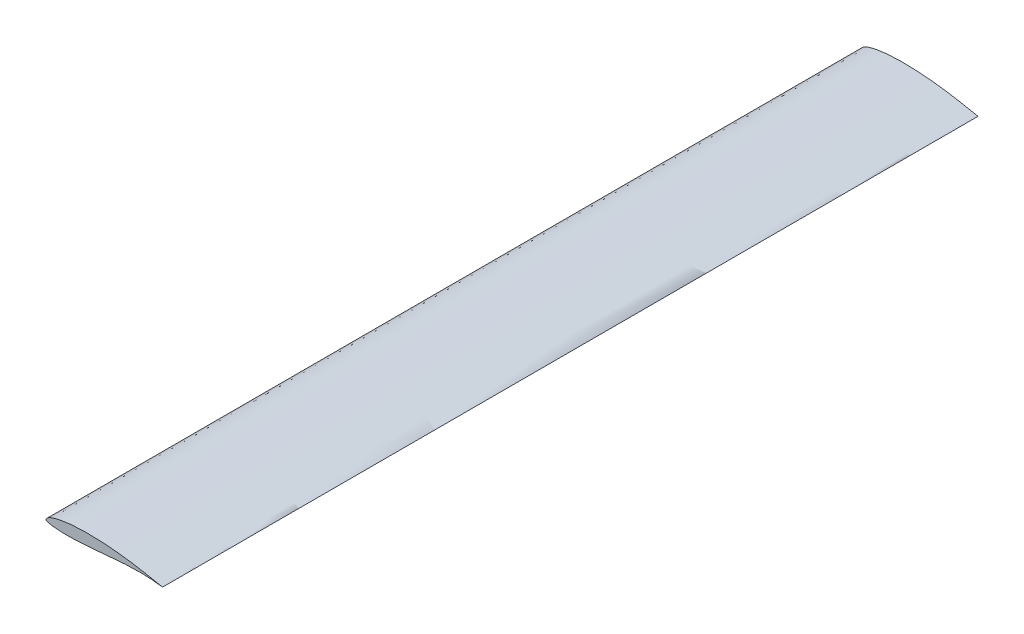
ISO-10303-21;
HEADER;
FILE_DESCRIPTION(('STEP AP214'),'2;1');
FILE_NAME('part.step','',(''),(''),'','','');
FILE_SCHEMA(('AUTOMOTIVE_DESIGN { 1 0 10303 214 1 1 1 1 }'));
ENDSEC;
DATA;
#1=APPLICATION_CONTEXT('core data for automotive mechanical design processes');
#2=APPLICATION_PROTOCOL_DEFINITION('international standard','automotive_design',2000,#1);
#3=PRODUCT_CONTEXT('',#1,'mechanical');
#4=PRODUCT('Part','Part','',(#3));
#5=PRODUCT_RELATED_PRODUCT_CATEGORY('part','',(#4));
#6=PRODUCT_DEFINITION_FORMATION('','',#4);
#7=PRODUCT_DEFINITION_CONTEXT('part definition',#1,'design');
#8=PRODUCT_DEFINITION('design','',#6,#7);
#9=PRODUCT_DEFINITION_SHAPE('','',#8);
#10=(LENGTH_UNIT() NAMED_UNIT(*) SI_UNIT(.MILLI.,.METRE.));
#11=(NAMED_UNIT(*) PLANE_ANGLE_UNIT() SI_UNIT($,.RADIAN.));
#12=(NAMED_UNIT(*) SI_UNIT($,.STERADIAN.) SOLID_ANGLE_UNIT());
#13=UNCERTAINTY_MEASURE_WITH_UNIT(LENGTH_MEASURE(1.E-05),#10,'distance_accuracy_value','');
#14=(GEOMETRIC_REPRESENTATION_CONTEXT(3) GLOBAL_UNCERTAINTY_ASSIGNED_CONTEXT((#13)) GLOBAL_UNIT_ASSIGNED_CONTEXT((#10,
#11,#12)) REPRESENTATION_CONTEXT('',''));
#15=CARTESIAN_POINT('',(0.,0.,0.));
#16=DIRECTION('',(0.,0.,1.));
#17=DIRECTION('',(1.,0.,0.));
#18=AXIS2_PLACEMENT_3D('',#15,#16,#17);
#19=CARTESIAN_POINT('',(164.,0.,1147.5));
#20=CARTESIAN_POINT('',(164.001991598263,0.00531984976419303,1147.5));
#21=CARTESIAN_POINT('',(162.498434342582,0.297400202803964,1147.5));
#22=CARTESIAN_POINT('',(160.966285986864,0.616919952057619,1147.5));
#23=CARTESIAN_POINT('',(157.230075915864,1.3585498102464,1147.5));
#24=CARTESIAN_POINT('',(152.647727614488,2.27665522942378,1147.5));
#25=CARTESIAN_POINT('',(146.674778271279,3.45259340113249,1147.5));
#26=CARTESIAN_POINT('',(139.663921430945,4.78810763818938,1147.5));
#27=CARTESIAN_POINT('',(131.643002501888,6.22552345397432,1147.5));
#28=CARTESIAN_POINT('',(122.779722168183,7.67812054914313,1147.5));
#29=CARTESIAN_POINT('',(113.214717927563,9.06260953662403,1147.5));
#30=CARTESIAN_POINT('',(103.114761215838,10.3086780802257,1147.5));
#31=CARTESIAN_POINT('',(92.6533309547815,11.3668746634096,1147.5));
#32=CARTESIAN_POINT('',(82.0086806238588,12.1835709086589,1147.5));
#33=CARTESIAN_POINT('',(71.3637171378707,12.732678493942,1147.5));
#34=CARTESIAN_POINT('',(62.573062305257,12.9388201280609,1147.5));
#35=CARTESIAN_POINT('',(55.6792196157442,12.9316295832505,1147.5));
#36=CARTESIAN_POINT('',(50.6637926196718,12.8397286640108,1147.5));
#37=CARTESIAN_POINT('',(45.7821815615309,12.6594632047961,1147.5));
#38=CARTESIAN_POINT('',(41.0552392078456,12.3903784997006,1147.5));
#39=CARTESIAN_POINT('',(36.503682969376,12.0364374732333,1147.5));
#40=CARTESIAN_POINT('',(32.1469308752692,11.6017806713784,1147.5));
#41=CARTESIAN_POINT('',(28.0042399944486,11.0851428613257,1147.5));
#42=CARTESIAN_POINT('',(24.0917028645816,10.4983490102485,1147.5));
#43=CARTESIAN_POINT('',(20.4268224736298,9.84391818251182,1147.5));
#44=CARTESIAN_POINT('',(17.0258441320521,9.13083356361227,1147.5));
#45=CARTESIAN_POINT('',(13.9022307091455,8.36935884084965,1147.5));
#46=CARTESIAN_POINT('',(11.0683356300652,7.56556299579602,1147.5));
#47=CARTESIAN_POINT('',(8.53577437049558,6.72011862060174,1147.5));
#48=CARTESIAN_POINT('',(6.31237905524054,5.83291609249776,1147.5));
#49=CARTESIAN_POINT('',(4.41335195887076,4.89013994016945,1147.5));
#50=CARTESIAN_POINT('',(2.84511205003182,3.90324504676575,1147.5));
#51=CARTESIAN_POINT('',(1.62045759786148,2.90112706142947,1147.5));
#52=CARTESIAN_POINT('',(0.73116509275038,1.93808069211739,1147.5));
#53=CARTESIAN_POINT('',(0.179493112111483,1.06867443061584,1147.5));
#54=CARTESIAN_POINT('',(-0.0694620851703839,0.284825746109623,1147.5));
#55=CARTESIAN_POINT('',(0.134033799734411,-0.423690631352367,1147.5));
#56=CARTESIAN_POINT('',(0.764071957071735,-0.90315248643549,1147.5));
#57=CARTESIAN_POINT('',(1.66761423003734,-1.28501260569411,1147.5));
#58=CARTESIAN_POINT('',(2.89636931032193,-1.66786040813617,1147.5));
#59=CARTESIAN_POINT('',(4.45436899457472,-2.06075475528505,1147.5));
#60=CARTESIAN_POINT('',(6.34218466816148,-2.4632681114056,1147.5));
#61=CARTESIAN_POINT('',(8.55467856408679,-2.84918902931242,1147.5));
#62=CARTESIAN_POINT('',(11.0821535753536,-3.19703608864089,1147.5));
#63=CARTESIAN_POINT('',(13.9135484504474,-3.48962360207447,1147.5));
#64=CARTESIAN_POINT('',(17.0354737545351,-3.73342689550393,1147.5));
#65=CARTESIAN_POINT('',(20.4356518775566,-3.91918489225184,1147.5));
#66=CARTESIAN_POINT('',(24.099392464432,-4.05492611325174,1147.5));
#67=CARTESIAN_POINT('',(28.0108551367806,-4.12753853381065,1147.5));
#68=CARTESIAN_POINT('',(32.1529214072361,-4.14098809865655,1147.5));
#69=CARTESIAN_POINT('',(36.5088006016332,-4.08249920879109,1147.5));
#70=CARTESIAN_POINT('',(41.0598347493383,-3.94919102069968,1147.5));
#71=CARTESIAN_POINT('',(45.7862678553855,-3.73671060947181,1147.5));
#72=CARTESIAN_POINT('',(50.667246714286,-3.44561856035242,1147.5));
#73=CARTESIAN_POINT('',(55.6814877677775,-3.0779528117554,1147.5));
#74=CARTESIAN_POINT('',(62.5754290442507,-2.50996480013426,1147.5));
#75=CARTESIAN_POINT('',(71.3600135467517,-1.68784839412556,1147.5));
#76=CARTESIAN_POINT('',(81.9977407502253,-0.654631350776393,1147.5));
#77=CARTESIAN_POINT('',(92.6365558877666,0.330119403039373,1147.5));
#78=CARTESIAN_POINT('',(103.095163283197,1.17421806949481,1147.5));
#79=CARTESIAN_POINT('',(113.195150773304,1.80138175037423,1147.5));
#80=CARTESIAN_POINT('',(122.763237889367,2.17576205056045,1147.5));
#81=CARTESIAN_POINT('',(131.632477934741,2.28410167210576,1147.5));
#82=CARTESIAN_POINT('',(139.659679628837,2.14727547238049,1147.5));
#83=CARTESIAN_POINT('',(146.676584213066,1.82633503353171,1147.5));
#84=CARTESIAN_POINT('',(152.651459072662,1.37759986618992,1147.5));
#85=CARTESIAN_POINT('',(157.237589271037,0.92499442356592,1147.5));
#86=CARTESIAN_POINT('',(160.965141957451,0.442021742113606,1147.5));
#87=CARTESIAN_POINT('',(162.505368274,0.239871332988406,1147.5));
#88=CARTESIAN_POINT('',(163.998025245982,-0.00527485632708962,1147.5));
#89=CARTESIAN_POINT('',(164.,0.,1147.5));
#90=B_SPLINE_CURVE_WITH_KNOTS('',3,(#19,#20,#21,#22,#23,#24,#25,#26,#27,#28,#29,#30,#31,#32,#33,
#34,#35,#36,#37,#38,#39,#40,#41,#42,#43,#44,#45,#46,#47,#48,#49,#50,#51,#52,#53,#54,#55,#56,#57,
#58,#59,#60,#61,#62,#63,#64,#65,#66,#67,#68,#69,#70,#71,#72,#73,#74,#75,#76,#77,#78,#79,#80,#81,
#82,#83,#84,#85,#86,#87,#88,#89),.UNSPECIFIED.,.T.,.F.,(4,1,1,1,1,1,1,1,1,1,1,1,1,1,1,1,1,1,1,1,
1,1,1,1,1,1,1,1,1,1,1,1,1,1,1,1,1,1,1,1,1,1,1,1,1,1,1,1,1,1,1,1,1,1,1,1,1,1,1,1,1,1,1,1,1,1,1,1,
4),(0.,0.00214805430809599,0.00854975126519987,0.0190932027848274,0.0336019041127283,
0.0518116673579335,0.0734030864583847,0.0979694431410136,0.125069857849387,0.154220144730095,
0.184909693682051,0.216620255570926,0.2488107456543,0.280948926784429,0.312507484242747,
0.327906500971629,0.342968755764756,0.357635269802346,0.371852484683259,0.385561874386474,
0.398705234808855,0.411240180249529,0.423117643298698,0.434295112205051,0.444729134793795,
0.454375797563894,0.463214981564661,0.471223180029748,0.478387128907674,0.484734913353525,
0.490272764521108,0.49501957796766,0.498937389313408,0.502001720182591,0.504262280766223,
0.506099971808543,0.508217728904997,0.511109021456395,0.514949183066079,0.519768396621701,
0.525567785875162,0.532308946933197,0.539970427286293,0.548516151893645,0.557914395716619,
0.568140585296994,0.579150254833381,0.590897186744504,0.603335473672981,0.616414202216844,
0.630087791046481,0.64429599930344,0.658978179653156,0.67407735390885,0.689528146540666,
0.721210905240941,0.753454187324373,0.785684184668444,0.817334232856559,0.847849866464666,
0.876721279320122,0.90346839751331,0.927655073953592,0.948890458522587,0.966808426914461,
0.981110174299129,0.991529529203157,0.997870113187357,1.),.UNSPECIFIED.);
#91=DIRECTION('',(0.,0.,-1.));
#92=VECTOR('',#91,1.);
#93=SURFACE_OF_LINEAR_EXTRUSION('',#90,#92);
#94=CARTESIAN_POINT('',(164.,0.,1147.5));
#95=VERTEX_POINT('',#94);
#96=EDGE_CURVE('E10',#95,#95,#90,.T.);
#97=ORIENTED_EDGE('',*,*,#96,.F.);
#98=EDGE_LOOP('',(#97));
#99=FACE_BOUND('',#98,.T.);
#100=CARTESIAN_POINT('',(164.,0.,0.));
#101=CARTESIAN_POINT('',(164.001991598263,0.00531984976419303,0.));
#102=CARTESIAN_POINT('',(162.498434342582,0.297400202803964,0.));
#103=CARTESIAN_POINT('',(160.966285986864,0.616919952057619,0.));
#104=CARTESIAN_POINT('',(157.230075915864,1.3585498102464,0.));
#105=CARTESIAN_POINT('',(152.647727614488,2.27665522942378,0.));
#106=CARTESIAN_POINT('',(146.674778271279,3.45259340113249,0.));
#107=CARTESIAN_POINT('',(139.663921430945,4.78810763818938,0.));
#108=CARTESIAN_POINT('',(131.643002501888,6.22552345397432,0.));
#109=CARTESIAN_POINT('',(122.779722168183,7.67812054914313,0.));
#110=CARTESIAN_POINT('',(113.214717927563,9.06260953662403,0.));
#111=CARTESIAN_POINT('',(103.114761215838,10.3086780802257,0.));
#112=CARTESIAN_POINT('',(92.6533309547815,11.3668746634096,0.));
#113=CARTESIAN_POINT('',(82.0086806238588,12.1835709086589,0.));
#114=CARTESIAN_POINT('',(71.3637171378707,12.732678493942,0.));
#115=CARTESIAN_POINT('',(62.573062305257,12.9388201280609,0.));
#116=CARTESIAN_POINT('',(55.6792196157442,12.9316295832505,0.));
#117=CARTESIAN_POINT('',(50.6637926196718,12.8397286640108,0.));
#118=CARTESIAN_POINT('',(45.7821815615309,12.6594632047961,0.));
#119=CARTESIAN_POINT('',(41.0552392078456,12.3903784997006,0.));
#120=CARTESIAN_POINT('',(36.503682969376,12.0364374732333,0.));
#121=CARTESIAN_POINT('',(32.1469308752692,11.6017806713784,0.));
#122=CARTESIAN_POINT('',(28.0042399944486,11.0851428613257,0.));
#123=CARTESIAN_POINT('',(24.0917028645816,10.4983490102485,0.));
#124=CARTESIAN_POINT('',(20.4268224736298,9.84391818251182,0.));
#125=CARTESIAN_POINT('',(17.0258441320521,9.13083356361227,0.));
#126=CARTESIAN_POINT('',(13.9022307091455,8.36935884084965,0.));
#127=CARTESIAN_POINT('',(11.0683356300652,7.56556299579602,0.));
#128=CARTESIAN_POINT('',(8.53577437049558,6.72011862060174,0.));
#129=CARTESIAN_POINT('',(6.31237905524054,5.83291609249776,0.));
#130=CARTESIAN_POINT('',(4.41335195887076,4.89013994016945,0.));
#131=CARTESIAN_POINT('',(2.84511205003182,3.90324504676575,0.));
#132=CARTESIAN_POINT('',(1.62045759786148,2.90112706142947,0.));
#133=CARTESIAN_POINT('',(0.73116509275038,1.93808069211739,0.));
#134=CARTESIAN_POINT('',(0.179493112111483,1.06867443061584,0.));
#135=CARTESIAN_POINT('',(-0.0694620851703839,0.284825746109623,0.));
#136=CARTESIAN_POINT('',(0.134033799734411,-0.423690631352367,0.));
#137=CARTESIAN_POINT('',(0.764071957071735,-0.90315248643549,0.));
#138=CARTESIAN_POINT('',(1.66761423003734,-1.28501260569411,0.));
#139=CARTESIAN_POINT('',(2.89636931032193,-1.66786040813617,0.));
#140=CARTESIAN_POINT('',(4.45436899457472,-2.06075475528505,0.));
#141=CARTESIAN_POINT('',(6.34218466816148,-2.4632681114056,0.));
#142=CARTESIAN_POINT('',(8.55467856408679,-2.84918902931242,0.));
#143=CARTESIAN_POINT('',(11.0821535753536,-3.19703608864089,0.));
#144=CARTESIAN_POINT('',(13.9135484504474,-3.48962360207447,0.));
#145=CARTESIAN_POINT('',(17.0354737545351,-3.73342689550393,0.));
#146=CARTESIAN_POINT('',(20.4356518775566,-3.91918489225184,0.));
#147=CARTESIAN_POINT('',(24.099392464432,-4.05492611325174,0.));
#148=CARTESIAN_POINT('',(28.0108551367806,-4.12753853381065,0.));
#149=CARTESIAN_POINT('',(32.1529214072361,-4.14098809865655,0.));
#150=CARTESIAN_POINT('',(36.5088006016332,-4.08249920879109,0.));
#151=CARTESIAN_POINT('',(41.0598347493383,-3.94919102069968,0.));
#152=CARTESIAN_POINT('',(45.7862678553855,-3.73671060947181,0.));
#153=CARTESIAN_POINT('',(50.667246714286,-3.44561856035242,0.));
#154=CARTESIAN_POINT('',(55.6814877677775,-3.0779528117554,0.));
#155=CARTESIAN_POINT('',(62.5754290442507,-2.50996480013426,0.));
#156=CARTESIAN_POINT('',(71.3600135467517,-1.68784839412556,0.));
#157=CARTESIAN_POINT('',(81.9977407502253,-0.654631350776393,0.));
#158=CARTESIAN_POINT('',(92.6365558877666,0.330119403039373,0.));
#159=CARTESIAN_POINT('',(103.095163283197,1.17421806949481,0.));
#160=CARTESIAN_POINT('',(113.195150773304,1.80138175037423,0.));
#161=CARTESIAN_POINT('',(122.763237889367,2.17576205056045,0.));
#162=CARTESIAN_POINT('',(131.632477934741,2.28410167210576,0.));
#163=CARTESIAN_POINT('',(139.659679628837,2.14727547238049,0.));
#164=CARTESIAN_POINT('',(146.676584213066,1.82633503353171,0.));
#165=CARTESIAN_POINT('',(152.651459072662,1.37759986618992,0.));
#166=CARTESIAN_POINT('',(157.237589271037,0.92499442356592,0.));
#167=CARTESIAN_POINT('',(160.965141957451,0.442021742113606,0.));
#168=CARTESIAN_POINT('',(162.505368274,0.239871332988406,0.));
#169=CARTESIAN_POINT('',(163.998025245982,-0.00527485632708962,0.));
#170=CARTESIAN_POINT('',(164.,0.,0.));
#171=B_SPLINE_CURVE_WITH_KNOTS('',3,(#100,#101,#102,#103,#104,#105,#106,#107,#108,#109,#110,
#111,#112,#113,#114,#115,#116,#117,#118,#119,#120,#121,#122,#123,#124,#125,#126,#127,#128,#129,
#130,#131,#132,#133,#134,#135,#136,#137,#138,#139,#140,#141,#142,#143,#144,#145,#146,#147,#148,
#149,#150,#151,#152,#153,#154,#155,#156,#157,#158,#159,#160,#161,#162,#163,#164,#165,#166,#167,
#168,#169,#170),.UNSPECIFIED.,.T.,.F.,(4,1,1,1,1,1,1,1,1,1,1,1,1,1,1,1,1,1,1,1,1,1,1,1,1,1,1,1,
1,1,1,1,1,1,1,1,1,1,1,1,1,1,1,1,1,1,1,1,1,1,1,1,1,1,1,1,1,1,1,1,1,1,1,1,1,1,1,1,4),(0.,
0.00214805430809599,0.00854975126519987,0.0190932027848274,0.0336019041127283,
0.0518116673579335,0.0734030864583847,0.0979694431410136,0.125069857849387,0.154220144730095,
0.184909693682051,0.216620255570926,0.2488107456543,0.280948926784429,0.312507484242747,
0.327906500971629,0.342968755764756,0.357635269802346,0.371852484683259,0.385561874386474,
0.398705234808855,0.411240180249529,0.423117643298698,0.434295112205051,0.444729134793795,
0.454375797563894,0.463214981564661,0.471223180029748,0.478387128907674,0.484734913353525,
0.490272764521108,0.49501957796766,0.498937389313408,0.502001720182591,0.504262280766223,
0.506099971808543,0.508217728904997,0.511109021456395,0.514949183066079,0.519768396621701,
0.525567785875162,0.532308946933197,0.539970427286293,0.548516151893645,0.557914395716619,
0.568140585296994,0.579150254833381,0.590897186744504,0.603335473672981,0.616414202216844,
0.630087791046481,0.64429599930344,0.658978179653156,0.67407735390885,0.689528146540666,
0.721210905240941,0.753454187324373,0.785684184668444,0.817334232856559,0.847849866464666,
0.876721279320122,0.90346839751331,0.927655073953592,0.948890458522587,0.966808426914461,
0.981110174299129,0.991529529203157,0.997870113187357,1.),.UNSPECIFIED.);
#172=CARTESIAN_POINT('',(164.,0.,0.));
#173=VERTEX_POINT('',#172);
#174=EDGE_CURVE('E34',#173,#173,#171,.T.);
#175=ORIENTED_EDGE('',*,*,#174,.T.);
#176=EDGE_LOOP('',(#175));
#177=FACE_BOUND('',#176,.T.);
#178=ADVANCED_FACE('F30',(#99,#177),#93,.F.);
#179=CARTESIAN_POINT('',(0.497831009909553,1.55232615021857,1147.5));
#180=DIRECTION('',(0.,0.,-1.));
#181=DIRECTION('',(-1.,0.,0.));
#182=AXIS2_PLACEMENT_3D('',#179,#180,#181);
#183=PLANE('',#182);
#184=ORIENTED_EDGE('',*,*,#96,.T.);
#185=EDGE_LOOP('',(#184));
#186=FACE_BOUND('',#185,.T.);
#187=ADVANCED_FACE('F53',(#186),#183,.F.);
#188=CARTESIAN_POINT('',(0.497831009909553,1.55232615021857,0.));
#189=DIRECTION('',(0.,0.,-1.));
#190=DIRECTION('',(-1.,0.,0.));
#191=AXIS2_PLACEMENT_3D('',#188,#189,#190);
#192=PLANE('',#191);
#193=ORIENTED_EDGE('',*,*,#174,.F.);
#194=EDGE_LOOP('',(#193));
#195=FACE_BOUND('',#194,.T.);
#196=ADVANCED_FACE('F51',(#195),#192,.T.);
#197=CLOSED_SHELL('',(#178,#187,#196));
#198=MANIFOLD_SOLID_BREP('B2',#197);
#199=ADVANCED_BREP_SHAPE_REPRESENTATION('',(#18,#198),#14);
#200=SHAPE_DEFINITION_REPRESENTATION(#9,#199);
ENDSEC;
END-ISO-10303-21;
